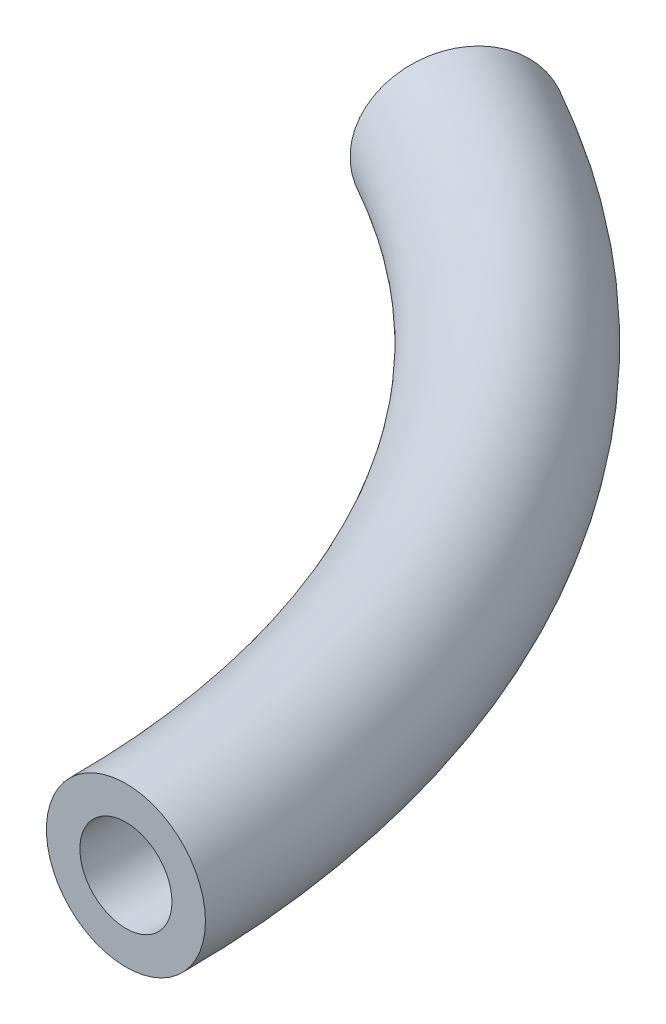
ISO-10303-21;
HEADER;
FILE_DESCRIPTION(('STEP AP214'),'2;1');
FILE_NAME('part.step','',(''),(''),'','','');
FILE_SCHEMA(('AUTOMOTIVE_DESIGN { 1 0 10303 214 1 1 1 1 }'));
ENDSEC;
DATA;
#1=APPLICATION_CONTEXT('core data for automotive mechanical design processes');
#2=APPLICATION_PROTOCOL_DEFINITION('international standard','automotive_design',2000,#1);
#3=PRODUCT_CONTEXT('',#1,'mechanical');
#4=PRODUCT('Part','Part','',(#3));
#5=PRODUCT_RELATED_PRODUCT_CATEGORY('part','',(#4));
#6=PRODUCT_DEFINITION_FORMATION('','',#4);
#7=PRODUCT_DEFINITION_CONTEXT('part definition',#1,'design');
#8=PRODUCT_DEFINITION('design','',#6,#7);
#9=PRODUCT_DEFINITION_SHAPE('','',#8);
#10=(LENGTH_UNIT() NAMED_UNIT(*) SI_UNIT(.MILLI.,.METRE.));
#11=(NAMED_UNIT(*) PLANE_ANGLE_UNIT() SI_UNIT($,.RADIAN.));
#12=(NAMED_UNIT(*) SI_UNIT($,.STERADIAN.) SOLID_ANGLE_UNIT());
#13=UNCERTAINTY_MEASURE_WITH_UNIT(LENGTH_MEASURE(1.E-05),#10,'distance_accuracy_value','');
#14=(GEOMETRIC_REPRESENTATION_CONTEXT(3) GLOBAL_UNCERTAINTY_ASSIGNED_CONTEXT((#13)) GLOBAL_UNIT_ASSIGNED_CONTEXT((#10,
#11,#12)) REPRESENTATION_CONTEXT('',''));
#15=CARTESIAN_POINT('',(0.,0.,0.));
#16=DIRECTION('',(0.,0.,1.));
#17=DIRECTION('',(1.,0.,0.));
#18=AXIS2_PLACEMENT_3D('',#15,#16,#17);
#19=CARTESIAN_POINT('',(0.,0.,0.));
#20=DIRECTION('',(0.,-1.,0.));
#21=DIRECTION('',(0.,0.,-1.));
#22=AXIS2_PLACEMENT_3D('',#19,#20,#21);
#23=TOROIDAL_SURFACE('',#22,33.,2.85);
#24=CARTESIAN_POINT('',(16.1153286299576,0.,-28.7975030714204));
#25=DIRECTION('',(0.872651608224862,0.,0.488343291816896));
#26=DIRECTION('',(0.488343291816896,0.,-0.872651608224862));
#27=AXIS2_PLACEMENT_3D('',#24,#25,#26);
#28=CIRCLE('',#27,2.85);
#29=CARTESIAN_POINT('',(17.5071070116357,0.,-31.2845601548613));
#30=VERTEX_POINT('',#29);
#31=EDGE_CURVE('E10',#30,#30,#28,.T.);
#32=CARTESIAN_POINT('',(33.,0.,0.));
#33=DIRECTION('',(0.,0.,1.));
#34=DIRECTION('',(1.,0.,0.));
#35=AXIS2_PLACEMENT_3D('',#32,#33,#34);
#36=CIRCLE('',#35,2.85);
#37=CARTESIAN_POINT('',(35.85,0.,0.));
#38=VERTEX_POINT('',#37);
#39=EDGE_CURVE('E35',#38,#38,#36,.T.);
#40=CARTESIAN_POINT('',(0.,0.,0.));
#41=DIRECTION('',(0.,-1.,0.));
#42=DIRECTION('',(0.,0.,-1.));
#43=AXIS2_PLACEMENT_3D('',#40,#41,#42);
#44=CIRCLE('',#43,35.85);
#45=EDGE_CURVE('',#30,#38,#44,.T.);
#46=ORIENTED_EDGE('',*,*,#31,.T.);
#47=ORIENTED_EDGE('',*,*,#39,.F.);
#48=ORIENTED_EDGE('',*,*,#45,.T.);
#49=ORIENTED_EDGE('',*,*,#45,.F.);
#50=EDGE_LOOP('',(#46,#48,#47,#49));
#51=FACE_BOUND('',#50,.T.);
#52=ADVANCED_FACE('F32',(#51),#23,.T.);
#53=CARTESIAN_POINT('',(16.1153286299576,0.,-28.7975030714204));
#54=DIRECTION('',(0.872651608224862,0.,0.488343291816896));
#55=DIRECTION('',(0.488343291816896,0.,-0.872651608224862));
#56=AXIS2_PLACEMENT_3D('',#53,#54,#55);
#57=PLANE('',#56);
#58=ORIENTED_EDGE('',*,*,#31,.F.);
#59=EDGE_LOOP('',(#58));
#60=FACE_BOUND('',#59,.T.);
#61=CARTESIAN_POINT('',(16.1153286299576,0.,-28.7975030714204));
#62=DIRECTION('',(0.872651608224862,0.,0.488343291816896));
#63=DIRECTION('',(0.488343291816896,0.,-0.872651608224862));
#64=AXIS2_PLACEMENT_3D('',#61,#62,#63);
#65=CIRCLE('',#64,1.65);
#66=CARTESIAN_POINT('',(16.9210950614555,0.,-30.2373782249915));
#67=VERTEX_POINT('',#66);
#68=EDGE_CURVE('E42',#67,#67,#65,.T.);
#69=ORIENTED_EDGE('',*,*,#68,.T.);
#70=EDGE_LOOP('',(#69));
#71=FACE_BOUND('',#70,.T.);
#72=ADVANCED_FACE('F50',(#60,#71),#57,.F.);
#73=CARTESIAN_POINT('',(33.,0.,0.));
#74=DIRECTION('',(0.,0.,1.));
#75=DIRECTION('',(1.,0.,0.));
#76=AXIS2_PLACEMENT_3D('',#73,#74,#75);
#77=PLANE('',#76);
#78=ORIENTED_EDGE('',*,*,#39,.T.);
#79=EDGE_LOOP('',(#78));
#80=FACE_BOUND('',#79,.T.);
#81=CARTESIAN_POINT('',(33.,0.,0.));
#82=DIRECTION('',(0.,0.,1.));
#83=DIRECTION('',(1.,0.,0.));
#84=AXIS2_PLACEMENT_3D('',#81,#82,#83);
#85=CIRCLE('',#84,1.65);
#86=CARTESIAN_POINT('',(34.65,0.,0.));
#87=VERTEX_POINT('',#86);
#88=EDGE_CURVE('E44',#87,#87,#85,.T.);
#89=ORIENTED_EDGE('',*,*,#88,.F.);
#90=EDGE_LOOP('',(#89));
#91=FACE_BOUND('',#90,.T.);
#92=ADVANCED_FACE('F55',(#80,#91),#77,.T.);
#93=CARTESIAN_POINT('',(0.,0.,0.));
#94=DIRECTION('',(0.,-1.,0.));
#95=DIRECTION('',(0.,0.,-1.));
#96=AXIS2_PLACEMENT_3D('',#93,#94,#95);
#97=TOROIDAL_SURFACE('',#96,33.,1.65);
#98=CARTESIAN_POINT('',(0.,0.,0.));
#99=DIRECTION('',(0.,-1.,0.));
#100=DIRECTION('',(0.,0.,-1.));
#101=AXIS2_PLACEMENT_3D('',#98,#99,#100);
#102=CIRCLE('',#101,34.65);
#103=EDGE_CURVE('',#67,#87,#102,.T.);
#104=ORIENTED_EDGE('',*,*,#68,.F.);
#105=ORIENTED_EDGE('',*,*,#88,.T.);
#106=ORIENTED_EDGE('',*,*,#103,.T.);
#107=ORIENTED_EDGE('',*,*,#103,.F.);
#108=EDGE_LOOP('',(#104,#106,#105,#107));
#109=FACE_BOUND('',#108,.T.);
#110=ADVANCED_FACE('F52',(#109),#97,.F.);
#111=CLOSED_SHELL('',(#52,#72,#92,#110));
#112=MANIFOLD_SOLID_BREP('B2',#111);
#113=ADVANCED_BREP_SHAPE_REPRESENTATION('',(#18,#112),#14);
#114=SHAPE_DEFINITION_REPRESENTATION(#9,#113);
ENDSEC;
END-ISO-10303-21;
